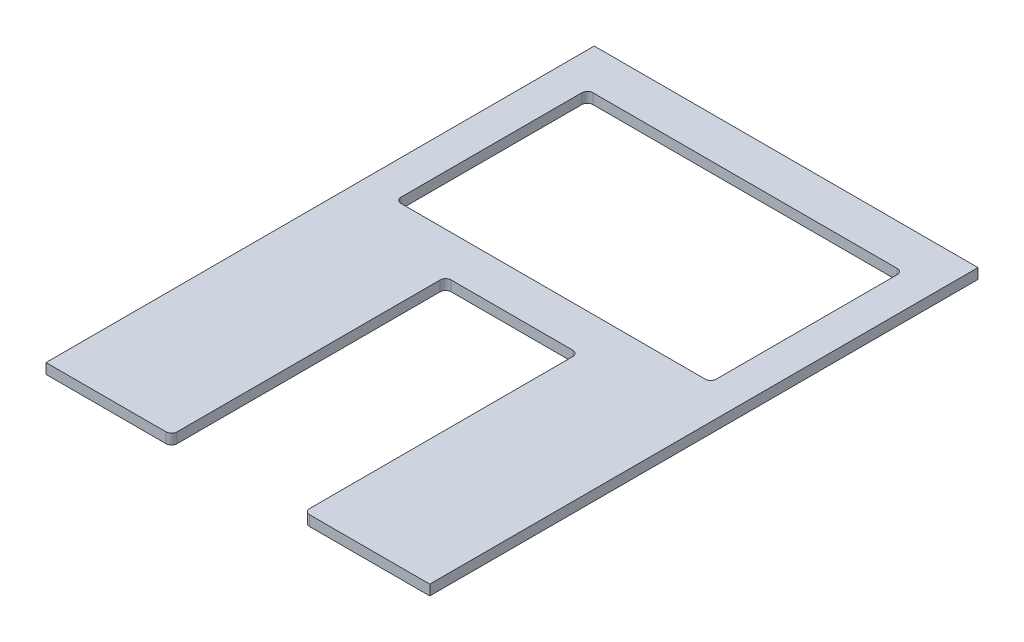
ISO-10303-21;
HEADER;
FILE_DESCRIPTION(('STEP AP214'),'2;1');
FILE_NAME('part.step','',(''),(''),'','','');
FILE_SCHEMA(('AUTOMOTIVE_DESIGN { 1 0 10303 214 1 1 1 1 }'));
ENDSEC;
DATA;
#1=APPLICATION_CONTEXT('core data for automotive mechanical design processes');
#2=APPLICATION_PROTOCOL_DEFINITION('international standard','automotive_design',2000,#1);
#3=PRODUCT_CONTEXT('',#1,'mechanical');
#4=PRODUCT('Part','Part','',(#3));
#5=PRODUCT_RELATED_PRODUCT_CATEGORY('part','',(#4));
#6=PRODUCT_DEFINITION_FORMATION('','',#4);
#7=PRODUCT_DEFINITION_CONTEXT('part definition',#1,'design');
#8=PRODUCT_DEFINITION('design','',#6,#7);
#9=PRODUCT_DEFINITION_SHAPE('','',#8);
#10=(LENGTH_UNIT() NAMED_UNIT(*) SI_UNIT(.MILLI.,.METRE.));
#11=(NAMED_UNIT(*) PLANE_ANGLE_UNIT() SI_UNIT($,.RADIAN.));
#12=(NAMED_UNIT(*) SI_UNIT($,.STERADIAN.) SOLID_ANGLE_UNIT());
#13=UNCERTAINTY_MEASURE_WITH_UNIT(LENGTH_MEASURE(1.E-05),#10,'distance_accuracy_value','');
#14=(GEOMETRIC_REPRESENTATION_CONTEXT(3) GLOBAL_UNCERTAINTY_ASSIGNED_CONTEXT((#13)) GLOBAL_UNIT_ASSIGNED_CONTEXT((#10,
#11,#12)) REPRESENTATION_CONTEXT('',''));
#15=CARTESIAN_POINT('',(0.,0.,0.));
#16=DIRECTION('',(0.,0.,1.));
#17=DIRECTION('',(1.,0.,0.));
#18=AXIS2_PLACEMENT_3D('',#15,#16,#17);
#19=CARTESIAN_POINT('',(-88.9,4.7625,127.));
#20=DIRECTION('',(0.,1.,0.));
#21=DIRECTION('',(0.,0.,1.));
#22=AXIS2_PLACEMENT_3D('',#19,#20,#21);
#23=PLANE('',#22);
#24=DIRECTION('',(0.,0.,1.));
#25=VECTOR('',#24,1.);
#26=CARTESIAN_POINT('',(30.734,4.7625,0.));
#27=LINE('',#26,#25);
#28=CARTESIAN_POINT('',(30.734,4.7625,2.53999999999994));
#29=VERTEX_POINT('',#28);
#30=CARTESIAN_POINT('',(30.734,4.7625,124.46));
#31=VERTEX_POINT('',#30);
#32=EDGE_CURVE('E181',#29,#31,#27,.T.);
#33=ORIENTED_EDGE('',*,*,#32,.T.);
#34=CARTESIAN_POINT('',(33.274,4.7625,124.46));
#35=DIRECTION('',(0.,1.,0.));
#36=DIRECTION('',(0.,0.,1.));
#37=AXIS2_PLACEMENT_3D('',#34,#35,#36);
#38=CIRCLE('',#37,2.54);
#39=CARTESIAN_POINT('',(33.274,4.7625,127.));
#40=VERTEX_POINT('',#39);
#41=EDGE_CURVE('E177',#31,#40,#38,.T.);
#42=ORIENTED_EDGE('',*,*,#41,.T.);
#43=DIRECTION('',(1.,0.,0.));
#44=VECTOR('',#43,1.);
#45=CARTESIAN_POINT('',(88.9,4.7625,127.));
#46=LINE('',#45,#44);
#47=CARTESIAN_POINT('',(88.9,4.7625,127.));
#48=VERTEX_POINT('',#47);
#49=EDGE_CURVE('E170',#40,#48,#46,.T.);
#50=ORIENTED_EDGE('',*,*,#49,.T.);
#51=DIRECTION('',(0.,0.,-1.));
#52=VECTOR('',#51,1.);
#53=CARTESIAN_POINT('',(88.9,4.7625,-127.));
#54=LINE('',#53,#52);
#55=CARTESIAN_POINT('',(88.9,4.7625,-127.));
#56=VERTEX_POINT('',#55);
#57=EDGE_CURVE('E174',#48,#56,#54,.T.);
#58=ORIENTED_EDGE('',*,*,#57,.T.);
#59=DIRECTION('',(-1.,0.,0.));
#60=VECTOR('',#59,1.);
#61=CARTESIAN_POINT('',(88.9,4.7625,-127.));
#62=LINE('',#61,#60);
#63=CARTESIAN_POINT('',(-88.9,4.7625,-127.));
#64=VERTEX_POINT('',#63);
#65=EDGE_CURVE('E196',#56,#64,#62,.T.);
#66=ORIENTED_EDGE('',*,*,#65,.T.);
#67=DIRECTION('',(0.,0.,1.));
#68=VECTOR('',#67,1.);
#69=CARTESIAN_POINT('',(-88.9,4.7625,-127.));
#70=LINE('',#69,#68);
#71=CARTESIAN_POINT('',(-88.9,4.7625,127.));
#72=VERTEX_POINT('',#71);
#73=EDGE_CURVE('E198',#64,#72,#70,.T.);
#74=ORIENTED_EDGE('',*,*,#73,.T.);
#75=DIRECTION('',(1.,0.,0.));
#76=VECTOR('',#75,1.);
#77=CARTESIAN_POINT('',(-30.734,4.7625,127.));
#78=LINE('',#77,#76);
#79=CARTESIAN_POINT('',(-33.274,4.7625,127.));
#80=VERTEX_POINT('',#79);
#81=EDGE_CURVE('E224',#72,#80,#78,.T.);
#82=ORIENTED_EDGE('',*,*,#81,.T.);
#83=CARTESIAN_POINT('',(-33.274,4.7625,124.46));
#84=DIRECTION('',(0.,1.,0.));
#85=DIRECTION('',(0.,0.,1.));
#86=AXIS2_PLACEMENT_3D('',#83,#84,#85);
#87=CIRCLE('',#86,2.54);
#88=CARTESIAN_POINT('',(-30.734,4.7625,124.46));
#89=VERTEX_POINT('',#88);
#90=EDGE_CURVE('E241',#80,#89,#87,.T.);
#91=ORIENTED_EDGE('',*,*,#90,.T.);
#92=DIRECTION('',(0.,0.,-1.));
#93=VECTOR('',#92,1.);
#94=CARTESIAN_POINT('',(-30.734,4.7625,127.));
#95=LINE('',#94,#93);
#96=CARTESIAN_POINT('',(-30.734,4.7625,2.53999999999994));
#97=VERTEX_POINT('',#96);
#98=EDGE_CURVE('E332',#89,#97,#95,.T.);
#99=ORIENTED_EDGE('',*,*,#98,.T.);
#100=CARTESIAN_POINT('',(-28.194,4.7625,2.53999999999994));
#101=DIRECTION('',(0.,1.,0.));
#102=DIRECTION('',(0.,0.,1.));
#103=AXIS2_PLACEMENT_3D('',#100,#101,#102);
#104=CIRCLE('',#103,2.54);
#105=CARTESIAN_POINT('',(-28.194,4.7625,0.));
#106=VERTEX_POINT('',#105);
#107=EDGE_CURVE('E277',#97,#106,#104,.F.);
#108=ORIENTED_EDGE('',*,*,#107,.T.);
#109=DIRECTION('',(1.,0.,0.));
#110=VECTOR('',#109,1.);
#111=CARTESIAN_POINT('',(-30.734,4.7625,0.));
#112=LINE('',#111,#110);
#113=CARTESIAN_POINT('',(28.194,4.7625,0.));
#114=VERTEX_POINT('',#113);
#115=EDGE_CURVE('E335',#106,#114,#112,.T.);
#116=ORIENTED_EDGE('',*,*,#115,.T.);
#117=CARTESIAN_POINT('',(28.194,4.7625,2.53999999999994));
#118=DIRECTION('',(0.,1.,0.));
#119=DIRECTION('',(0.,0.,1.));
#120=AXIS2_PLACEMENT_3D('',#117,#118,#119);
#121=CIRCLE('',#120,2.54);
#122=EDGE_CURVE('E281',#114,#29,#121,.F.);
#123=ORIENTED_EDGE('',*,*,#122,.T.);
#124=EDGE_LOOP('',(#33,#42,#50,#58,#66,#74,#82,#91,#99,#108,#116,#123));
#125=FACE_BOUND('',#124,.T.);
#126=DIRECTION('',(1.,0.,0.));
#127=VECTOR('',#126,1.);
#128=CARTESIAN_POINT('',(73.025,4.7625,-19.05));
#129=LINE('',#128,#127);
#130=CARTESIAN_POINT('',(-70.485,4.7625,-19.05));
#131=VERTEX_POINT('',#130);
#132=CARTESIAN_POINT('',(70.485,4.7625,-19.05));
#133=VERTEX_POINT('',#132);
#134=EDGE_CURVE('E320',#131,#133,#129,.T.);
#135=ORIENTED_EDGE('',*,*,#134,.F.);
#136=CARTESIAN_POINT('',(-70.485,4.7625,-21.59));
#137=DIRECTION('',(0.,1.,0.));
#138=DIRECTION('',(0.,0.,1.));
#139=AXIS2_PLACEMENT_3D('',#136,#137,#138);
#140=CIRCLE('',#139,2.54);
#141=CARTESIAN_POINT('',(-73.025,4.7625,-21.59));
#142=VERTEX_POINT('',#141);
#143=EDGE_CURVE('E285',#131,#142,#140,.F.);
#144=ORIENTED_EDGE('',*,*,#143,.T.);
#145=DIRECTION('',(0.,0.,1.));
#146=VECTOR('',#145,1.);
#147=CARTESIAN_POINT('',(-73.025,4.7625,-107.95));
#148=LINE('',#147,#146);
#149=CARTESIAN_POINT('',(-73.025,4.7625,-105.41));
#150=VERTEX_POINT('',#149);
#151=EDGE_CURVE('E314',#150,#142,#148,.T.);
#152=ORIENTED_EDGE('',*,*,#151,.F.);
#153=CARTESIAN_POINT('',(-70.485,4.7625,-105.41));
#154=DIRECTION('',(0.,1.,0.));
#155=DIRECTION('',(0.,0.,1.));
#156=AXIS2_PLACEMENT_3D('',#153,#154,#155);
#157=CIRCLE('',#156,2.54);
#158=CARTESIAN_POINT('',(-70.485,4.7625,-107.95));
#159=VERTEX_POINT('',#158);
#160=EDGE_CURVE('E11',#150,#159,#157,.F.);
#161=ORIENTED_EDGE('',*,*,#160,.T.);
#162=DIRECTION('',(-1.,0.,0.));
#163=VECTOR('',#162,1.);
#164=CARTESIAN_POINT('',(73.025,4.7625,-107.95));
#165=LINE('',#164,#163);
#166=CARTESIAN_POINT('',(70.485,4.7625,-107.95));
#167=VERTEX_POINT('',#166);
#168=EDGE_CURVE('E208',#167,#159,#165,.T.);
#169=ORIENTED_EDGE('',*,*,#168,.F.);
#170=CARTESIAN_POINT('',(70.485,4.7625,-105.41));
#171=DIRECTION('',(0.,1.,0.));
#172=DIRECTION('',(0.,0.,1.));
#173=AXIS2_PLACEMENT_3D('',#170,#171,#172);
#174=CIRCLE('',#173,2.54);
#175=CARTESIAN_POINT('',(73.025,4.7625,-105.41));
#176=VERTEX_POINT('',#175);
#177=EDGE_CURVE('E48',#167,#176,#174,.F.);
#178=ORIENTED_EDGE('',*,*,#177,.T.);
#179=DIRECTION('',(0.,0.,-1.));
#180=VECTOR('',#179,1.);
#181=CARTESIAN_POINT('',(73.025,4.7625,-107.95));
#182=LINE('',#181,#180);
#183=CARTESIAN_POINT('',(73.025,4.7625,-21.59));
#184=VERTEX_POINT('',#183);
#185=EDGE_CURVE('E318',#184,#176,#182,.T.);
#186=ORIENTED_EDGE('',*,*,#185,.F.);
#187=CARTESIAN_POINT('',(70.485,4.7625,-21.59));
#188=DIRECTION('',(0.,1.,0.));
#189=DIRECTION('',(0.,0.,1.));
#190=AXIS2_PLACEMENT_3D('',#187,#188,#189);
#191=CIRCLE('',#190,2.54);
#192=EDGE_CURVE('E289',#184,#133,#191,.F.);
#193=ORIENTED_EDGE('',*,*,#192,.T.);
#194=EDGE_LOOP('',(#135,#144,#152,#161,#169,#178,#186,#193));
#195=FACE_BOUND('',#194,.T.);
#196=ADVANCED_FACE('F33',(#125,#195),#23,.T.);
#197=CARTESIAN_POINT('',(-88.9,0.,127.));
#198=DIRECTION('',(0.,1.,0.));
#199=DIRECTION('',(0.,0.,1.));
#200=AXIS2_PLACEMENT_3D('',#197,#198,#199);
#201=PLANE('',#200);
#202=DIRECTION('',(1.,0.,0.));
#203=VECTOR('',#202,1.);
#204=CARTESIAN_POINT('',(88.9,0.,127.));
#205=LINE('',#204,#203);
#206=CARTESIAN_POINT('',(33.274,0.,127.));
#207=VERTEX_POINT('',#206);
#208=CARTESIAN_POINT('',(88.9,0.,127.));
#209=VERTEX_POINT('',#208);
#210=EDGE_CURVE('E187',#207,#209,#205,.T.);
#211=ORIENTED_EDGE('',*,*,#210,.F.);
#212=CARTESIAN_POINT('',(33.274,0.,124.46));
#213=DIRECTION('',(0.,1.,0.));
#214=DIRECTION('',(0.,0.,1.));
#215=AXIS2_PLACEMENT_3D('',#212,#213,#214);
#216=CIRCLE('',#215,2.54);
#217=CARTESIAN_POINT('',(30.734,0.,124.46));
#218=VERTEX_POINT('',#217);
#219=EDGE_CURVE('E234',#207,#218,#216,.F.);
#220=ORIENTED_EDGE('',*,*,#219,.T.);
#221=DIRECTION('',(0.,0.,1.));
#222=VECTOR('',#221,1.);
#223=CARTESIAN_POINT('',(30.734,0.,0.));
#224=LINE('',#223,#222);
#225=CARTESIAN_POINT('',(30.734,0.,2.53999999999994));
#226=VERTEX_POINT('',#225);
#227=EDGE_CURVE('E214',#226,#218,#224,.T.);
#228=ORIENTED_EDGE('',*,*,#227,.F.);
#229=CARTESIAN_POINT('',(28.194,0.,2.53999999999994));
#230=DIRECTION('',(0.,1.,0.));
#231=DIRECTION('',(0.,0.,1.));
#232=AXIS2_PLACEMENT_3D('',#229,#230,#231);
#233=CIRCLE('',#232,2.54);
#234=CARTESIAN_POINT('',(28.194,0.,0.));
#235=VERTEX_POINT('',#234);
#236=EDGE_CURVE('E279',#226,#235,#233,.T.);
#237=ORIENTED_EDGE('',*,*,#236,.T.);
#238=DIRECTION('',(1.,0.,0.));
#239=VECTOR('',#238,1.);
#240=CARTESIAN_POINT('',(-30.734,0.,0.));
#241=LINE('',#240,#239);
#242=CARTESIAN_POINT('',(-28.194,0.,0.));
#243=VERTEX_POINT('',#242);
#244=EDGE_CURVE('E211',#243,#235,#241,.T.);
#245=ORIENTED_EDGE('',*,*,#244,.F.);
#246=CARTESIAN_POINT('',(-28.194,0.,2.53999999999994));
#247=DIRECTION('',(0.,1.,0.));
#248=DIRECTION('',(0.,0.,1.));
#249=AXIS2_PLACEMENT_3D('',#246,#247,#248);
#250=CIRCLE('',#249,2.54);
#251=CARTESIAN_POINT('',(-30.734,0.,2.53999999999994));
#252=VERTEX_POINT('',#251);
#253=EDGE_CURVE('E275',#243,#252,#250,.T.);
#254=ORIENTED_EDGE('',*,*,#253,.T.);
#255=DIRECTION('',(0.,0.,-1.));
#256=VECTOR('',#255,1.);
#257=CARTESIAN_POINT('',(-30.734,0.,127.));
#258=LINE('',#257,#256);
#259=CARTESIAN_POINT('',(-30.734,0.,124.46));
#260=VERTEX_POINT('',#259);
#261=EDGE_CURVE('E207',#260,#252,#258,.T.);
#262=ORIENTED_EDGE('',*,*,#261,.F.);
#263=CARTESIAN_POINT('',(-33.274,0.,124.46));
#264=DIRECTION('',(0.,1.,0.));
#265=DIRECTION('',(0.,0.,1.));
#266=AXIS2_PLACEMENT_3D('',#263,#264,#265);
#267=CIRCLE('',#266,2.54);
#268=CARTESIAN_POINT('',(-33.274,0.,127.));
#269=VERTEX_POINT('',#268);
#270=EDGE_CURVE('E232',#260,#269,#267,.F.);
#271=ORIENTED_EDGE('',*,*,#270,.T.);
#272=DIRECTION('',(1.,0.,0.));
#273=VECTOR('',#272,1.);
#274=CARTESIAN_POINT('',(-30.734,0.,127.));
#275=LINE('',#274,#273);
#276=CARTESIAN_POINT('',(-88.9,0.,127.));
#277=VERTEX_POINT('',#276);
#278=EDGE_CURVE('E204',#277,#269,#275,.T.);
#279=ORIENTED_EDGE('',*,*,#278,.F.);
#280=DIRECTION('',(0.,0.,1.));
#281=VECTOR('',#280,1.);
#282=CARTESIAN_POINT('',(-88.9,0.,-127.));
#283=LINE('',#282,#281);
#284=CARTESIAN_POINT('',(-88.9,0.,-127.));
#285=VERTEX_POINT('',#284);
#286=EDGE_CURVE('E222',#285,#277,#283,.T.);
#287=ORIENTED_EDGE('',*,*,#286,.F.);
#288=DIRECTION('',(-1.,0.,0.));
#289=VECTOR('',#288,1.);
#290=CARTESIAN_POINT('',(88.9,0.,-127.));
#291=LINE('',#290,#289);
#292=CARTESIAN_POINT('',(88.9,0.,-127.));
#293=VERTEX_POINT('',#292);
#294=EDGE_CURVE('E220',#293,#285,#291,.T.);
#295=ORIENTED_EDGE('',*,*,#294,.F.);
#296=DIRECTION('',(0.,0.,-1.));
#297=VECTOR('',#296,1.);
#298=CARTESIAN_POINT('',(88.9,0.,-127.));
#299=LINE('',#298,#297);
#300=EDGE_CURVE('E218',#209,#293,#299,.T.);
#301=ORIENTED_EDGE('',*,*,#300,.F.);
#302=EDGE_LOOP('',(#211,#220,#228,#237,#245,#254,#262,#271,#279,#287,#295,#301));
#303=FACE_BOUND('',#302,.T.);
#304=DIRECTION('',(-1.,0.,0.));
#305=VECTOR('',#304,1.);
#306=CARTESIAN_POINT('',(73.025,0.,-107.95));
#307=LINE('',#306,#305);
#308=CARTESIAN_POINT('',(70.485,0.,-107.95));
#309=VERTEX_POINT('',#308);
#310=CARTESIAN_POINT('',(-70.485,0.,-107.95));
#311=VERTEX_POINT('',#310);
#312=EDGE_CURVE('E300',#309,#311,#307,.T.);
#313=ORIENTED_EDGE('',*,*,#312,.T.);
#314=CARTESIAN_POINT('',(-70.485,0.,-105.41));
#315=DIRECTION('',(0.,1.,0.));
#316=DIRECTION('',(0.,0.,1.));
#317=AXIS2_PLACEMENT_3D('',#314,#315,#316);
#318=CIRCLE('',#317,2.54);
#319=CARTESIAN_POINT('',(-73.025,0.,-105.41));
#320=VERTEX_POINT('',#319);
#321=EDGE_CURVE('E41',#311,#320,#318,.T.);
#322=ORIENTED_EDGE('',*,*,#321,.T.);
#323=DIRECTION('',(0.,0.,1.));
#324=VECTOR('',#323,1.);
#325=CARTESIAN_POINT('',(-73.025,0.,-107.95));
#326=LINE('',#325,#324);
#327=CARTESIAN_POINT('',(-73.025,0.,-21.59));
#328=VERTEX_POINT('',#327);
#329=EDGE_CURVE('E298',#320,#328,#326,.T.);
#330=ORIENTED_EDGE('',*,*,#329,.T.);
#331=CARTESIAN_POINT('',(-70.485,0.,-21.59));
#332=DIRECTION('',(0.,1.,0.));
#333=DIRECTION('',(0.,0.,1.));
#334=AXIS2_PLACEMENT_3D('',#331,#332,#333);
#335=CIRCLE('',#334,2.54);
#336=CARTESIAN_POINT('',(-70.485,0.,-19.05));
#337=VERTEX_POINT('',#336);
#338=EDGE_CURVE('E283',#328,#337,#335,.T.);
#339=ORIENTED_EDGE('',*,*,#338,.T.);
#340=DIRECTION('',(1.,0.,0.));
#341=VECTOR('',#340,1.);
#342=CARTESIAN_POINT('',(73.025,0.,-19.05));
#343=LINE('',#342,#341);
#344=CARTESIAN_POINT('',(70.485,0.,-19.05));
#345=VERTEX_POINT('',#344);
#346=EDGE_CURVE('E309',#337,#345,#343,.T.);
#347=ORIENTED_EDGE('',*,*,#346,.T.);
#348=CARTESIAN_POINT('',(70.485,0.,-21.59));
#349=DIRECTION('',(0.,1.,0.));
#350=DIRECTION('',(0.,0.,1.));
#351=AXIS2_PLACEMENT_3D('',#348,#349,#350);
#352=CIRCLE('',#351,2.54);
#353=CARTESIAN_POINT('',(73.025,0.,-21.59));
#354=VERTEX_POINT('',#353);
#355=EDGE_CURVE('E287',#345,#354,#352,.T.);
#356=ORIENTED_EDGE('',*,*,#355,.T.);
#357=DIRECTION('',(0.,0.,-1.));
#358=VECTOR('',#357,1.);
#359=CARTESIAN_POINT('',(73.025,0.,-107.95));
#360=LINE('',#359,#358);
#361=CARTESIAN_POINT('',(73.025,0.,-105.41));
#362=VERTEX_POINT('',#361);
#363=EDGE_CURVE('E326',#354,#362,#360,.T.);
#364=ORIENTED_EDGE('',*,*,#363,.T.);
#365=CARTESIAN_POINT('',(70.485,0.,-105.41));
#366=DIRECTION('',(0.,1.,0.));
#367=DIRECTION('',(0.,0.,1.));
#368=AXIS2_PLACEMENT_3D('',#365,#366,#367);
#369=CIRCLE('',#368,2.54);
#370=EDGE_CURVE('E291',#362,#309,#369,.T.);
#371=ORIENTED_EDGE('',*,*,#370,.T.);
#372=EDGE_LOOP('',(#313,#322,#330,#339,#347,#356,#364,#371));
#373=FACE_BOUND('',#372,.T.);
#374=ADVANCED_FACE('F297',(#303,#373),#201,.F.);
#375=CARTESIAN_POINT('',(-30.734,4.7625,127.));
#376=DIRECTION('',(0.,0.,-1.));
#377=DIRECTION('',(-1.,0.,0.));
#378=AXIS2_PLACEMENT_3D('',#375,#376,#377);
#379=PLANE('',#378);
#380=ORIENTED_EDGE('',*,*,#278,.T.);
#381=DIRECTION('',(0.,-1.,0.));
#382=VECTOR('',#381,1.);
#383=CARTESIAN_POINT('',(-33.274,4.7625,127.));
#384=LINE('',#383,#382);
#385=EDGE_CURVE('E249',#269,#80,#384,.F.);
#386=ORIENTED_EDGE('',*,*,#385,.T.);
#387=ORIENTED_EDGE('',*,*,#81,.F.);
#388=DIRECTION('',(0.,-1.,0.));
#389=VECTOR('',#388,1.);
#390=CARTESIAN_POINT('',(-88.9,4.7625,127.));
#391=LINE('',#390,#389);
#392=EDGE_CURVE('E203',#72,#277,#391,.T.);
#393=ORIENTED_EDGE('',*,*,#392,.T.);
#394=EDGE_LOOP('',(#380,#386,#387,#393));
#395=FACE_BOUND('',#394,.T.);
#396=ADVANCED_FACE('F359',(#395),#379,.F.);
#397=CARTESIAN_POINT('',(-30.734,4.7625,127.));
#398=DIRECTION('',(-1.,0.,0.));
#399=DIRECTION('',(0.,0.,1.));
#400=AXIS2_PLACEMENT_3D('',#397,#398,#399);
#401=PLANE('',#400);
#402=ORIENTED_EDGE('',*,*,#98,.F.);
#403=DIRECTION('',(0.,-1.,0.));
#404=VECTOR('',#403,1.);
#405=CARTESIAN_POINT('',(-30.734,4.7625,124.46));
#406=LINE('',#405,#404);
#407=EDGE_CURVE('E246',#89,#260,#406,.T.);
#408=ORIENTED_EDGE('',*,*,#407,.T.);
#409=ORIENTED_EDGE('',*,*,#261,.T.);
#410=DIRECTION('',(0.,-1.,0.));
#411=VECTOR('',#410,1.);
#412=CARTESIAN_POINT('',(-30.734,4.7625,2.53999999999994));
#413=LINE('',#412,#411);
#414=EDGE_CURVE('E244',#252,#97,#413,.F.);
#415=ORIENTED_EDGE('',*,*,#414,.T.);
#416=EDGE_LOOP('',(#402,#408,#409,#415));
#417=FACE_BOUND('',#416,.T.);
#418=ADVANCED_FACE('F367',(#417),#401,.F.);
#419=CARTESIAN_POINT('',(-30.734,4.7625,0.));
#420=DIRECTION('',(0.,0.,-1.));
#421=DIRECTION('',(-1.,0.,0.));
#422=AXIS2_PLACEMENT_3D('',#419,#420,#421);
#423=PLANE('',#422);
#424=ORIENTED_EDGE('',*,*,#115,.F.);
#425=DIRECTION('',(0.,-1.,0.));
#426=VECTOR('',#425,1.);
#427=CARTESIAN_POINT('',(-28.194,0.,0.));
#428=LINE('',#427,#426);
#429=EDGE_CURVE('E253',#106,#243,#428,.T.);
#430=ORIENTED_EDGE('',*,*,#429,.T.);
#431=ORIENTED_EDGE('',*,*,#244,.T.);
#432=DIRECTION('',(0.,-1.,0.));
#433=VECTOR('',#432,1.);
#434=CARTESIAN_POINT('',(28.194,4.7625,0.));
#435=LINE('',#434,#433);
#436=EDGE_CURVE('E251',#235,#114,#435,.F.);
#437=ORIENTED_EDGE('',*,*,#436,.T.);
#438=EDGE_LOOP('',(#424,#430,#431,#437));
#439=FACE_BOUND('',#438,.T.);
#440=ADVANCED_FACE('F375',(#439),#423,.F.);
#441=CARTESIAN_POINT('',(30.734,4.7625,0.));
#442=DIRECTION('',(1.,0.,0.));
#443=DIRECTION('',(0.,0.,-1.));
#444=AXIS2_PLACEMENT_3D('',#441,#442,#443);
#445=PLANE('',#444);
#446=ORIENTED_EDGE('',*,*,#227,.T.);
#447=DIRECTION('',(0.,-1.,0.));
#448=VECTOR('',#447,1.);
#449=CARTESIAN_POINT('',(30.734,4.7625,124.46));
#450=LINE('',#449,#448);
#451=EDGE_CURVE('E239',#218,#31,#450,.F.);
#452=ORIENTED_EDGE('',*,*,#451,.T.);
#453=ORIENTED_EDGE('',*,*,#32,.F.);
#454=DIRECTION('',(0.,-1.,0.));
#455=VECTOR('',#454,1.);
#456=CARTESIAN_POINT('',(30.734,0.,2.53999999999994));
#457=LINE('',#456,#455);
#458=EDGE_CURVE('E236',#29,#226,#457,.T.);
#459=ORIENTED_EDGE('',*,*,#458,.T.);
#460=EDGE_LOOP('',(#446,#452,#453,#459));
#461=FACE_BOUND('',#460,.T.);
#462=ADVANCED_FACE('F380',(#461),#445,.F.);
#463=CARTESIAN_POINT('',(88.9,4.7625,127.));
#464=DIRECTION('',(0.,0.,-1.));
#465=DIRECTION('',(-1.,0.,0.));
#466=AXIS2_PLACEMENT_3D('',#463,#464,#465);
#467=PLANE('',#466);
#468=ORIENTED_EDGE('',*,*,#49,.F.);
#469=DIRECTION('',(0.,-1.,0.));
#470=VECTOR('',#469,1.);
#471=CARTESIAN_POINT('',(33.274,4.7625,127.));
#472=LINE('',#471,#470);
#473=EDGE_CURVE('E190',#40,#207,#472,.T.);
#474=ORIENTED_EDGE('',*,*,#473,.T.);
#475=ORIENTED_EDGE('',*,*,#210,.T.);
#476=DIRECTION('',(0.,-1.,0.));
#477=VECTOR('',#476,1.);
#478=CARTESIAN_POINT('',(88.9,4.7625,127.));
#479=LINE('',#478,#477);
#480=EDGE_CURVE('E184',#48,#209,#479,.T.);
#481=ORIENTED_EDGE('',*,*,#480,.F.);
#482=EDGE_LOOP('',(#468,#474,#475,#481));
#483=FACE_BOUND('',#482,.T.);
#484=ADVANCED_FACE('F185',(#483),#467,.F.);
#485=CARTESIAN_POINT('',(88.9,4.7625,-127.));
#486=DIRECTION('',(-1.,0.,0.));
#487=DIRECTION('',(0.,0.,1.));
#488=AXIS2_PLACEMENT_3D('',#485,#486,#487);
#489=PLANE('',#488);
#490=ORIENTED_EDGE('',*,*,#300,.T.);
#491=DIRECTION('',(0.,-1.,0.));
#492=VECTOR('',#491,1.);
#493=CARTESIAN_POINT('',(88.9,4.7625,-127.));
#494=LINE('',#493,#492);
#495=EDGE_CURVE('E191',#56,#293,#494,.T.);
#496=ORIENTED_EDGE('',*,*,#495,.F.);
#497=ORIENTED_EDGE('',*,*,#57,.F.);
#498=ORIENTED_EDGE('',*,*,#480,.T.);
#499=EDGE_LOOP('',(#490,#496,#497,#498));
#500=FACE_BOUND('',#499,.T.);
#501=ADVANCED_FACE('F193',(#500),#489,.F.);
#502=CARTESIAN_POINT('',(88.9,4.7625,-127.));
#503=DIRECTION('',(0.,0.,1.));
#504=DIRECTION('',(1.,0.,0.));
#505=AXIS2_PLACEMENT_3D('',#502,#503,#504);
#506=PLANE('',#505);
#507=ORIENTED_EDGE('',*,*,#294,.T.);
#508=DIRECTION('',(0.,-1.,0.));
#509=VECTOR('',#508,1.);
#510=CARTESIAN_POINT('',(-88.9,4.7625,-127.));
#511=LINE('',#510,#509);
#512=EDGE_CURVE('E227',#64,#285,#511,.T.);
#513=ORIENTED_EDGE('',*,*,#512,.F.);
#514=ORIENTED_EDGE('',*,*,#65,.F.);
#515=ORIENTED_EDGE('',*,*,#495,.T.);
#516=EDGE_LOOP('',(#507,#513,#514,#515));
#517=FACE_BOUND('',#516,.T.);
#518=ADVANCED_FACE('F349',(#517),#506,.F.);
#519=CARTESIAN_POINT('',(-88.9,4.7625,-127.));
#520=DIRECTION('',(1.,0.,0.));
#521=DIRECTION('',(0.,0.,-1.));
#522=AXIS2_PLACEMENT_3D('',#519,#520,#521);
#523=PLANE('',#522);
#524=ORIENTED_EDGE('',*,*,#286,.T.);
#525=ORIENTED_EDGE('',*,*,#392,.F.);
#526=ORIENTED_EDGE('',*,*,#73,.F.);
#527=ORIENTED_EDGE('',*,*,#512,.T.);
#528=EDGE_LOOP('',(#524,#525,#526,#527));
#529=FACE_BOUND('',#528,.T.);
#530=ADVANCED_FACE('F356',(#529),#523,.F.);
#531=CARTESIAN_POINT('',(-73.025,4.7625,-107.95));
#532=DIRECTION('',(1.,0.,0.));
#533=DIRECTION('',(0.,0.,-1.));
#534=AXIS2_PLACEMENT_3D('',#531,#532,#533);
#535=PLANE('',#534);
#536=ORIENTED_EDGE('',*,*,#151,.T.);
#537=DIRECTION('',(0.,-1.,0.));
#538=VECTOR('',#537,1.);
#539=CARTESIAN_POINT('',(-73.025,0.,-21.59));
#540=LINE('',#539,#538);
#541=EDGE_CURVE('E258',#142,#328,#540,.T.);
#542=ORIENTED_EDGE('',*,*,#541,.T.);
#543=ORIENTED_EDGE('',*,*,#329,.F.);
#544=DIRECTION('',(0.,-1.,0.));
#545=VECTOR('',#544,1.);
#546=CARTESIAN_POINT('',(-73.025,4.7625,-105.41));
#547=LINE('',#546,#545);
#548=EDGE_CURVE('E256',#320,#150,#547,.F.);
#549=ORIENTED_EDGE('',*,*,#548,.T.);
#550=EDGE_LOOP('',(#536,#542,#543,#549));
#551=FACE_BOUND('',#550,.T.);
#552=ADVANCED_FACE('F306',(#551),#535,.T.);
#553=CARTESIAN_POINT('',(73.025,4.7625,-19.05));
#554=DIRECTION('',(0.,0.,-1.));
#555=DIRECTION('',(-1.,0.,0.));
#556=AXIS2_PLACEMENT_3D('',#553,#554,#555);
#557=PLANE('',#556);
#558=ORIENTED_EDGE('',*,*,#346,.F.);
#559=DIRECTION('',(0.,-1.,0.));
#560=VECTOR('',#559,1.);
#561=CARTESIAN_POINT('',(-70.485,4.7625,-19.05));
#562=LINE('',#561,#560);
#563=EDGE_CURVE('E264',#337,#131,#562,.F.);
#564=ORIENTED_EDGE('',*,*,#563,.T.);
#565=ORIENTED_EDGE('',*,*,#134,.T.);
#566=DIRECTION('',(0.,-1.,0.));
#567=VECTOR('',#566,1.);
#568=CARTESIAN_POINT('',(70.485,0.,-19.05));
#569=LINE('',#568,#567);
#570=EDGE_CURVE('E261',#133,#345,#569,.T.);
#571=ORIENTED_EDGE('',*,*,#570,.T.);
#572=EDGE_LOOP('',(#558,#564,#565,#571));
#573=FACE_BOUND('',#572,.T.);
#574=ADVANCED_FACE('F421',(#573),#557,.T.);
#575=CARTESIAN_POINT('',(73.025,4.7625,-107.95));
#576=DIRECTION('',(-1.,0.,0.));
#577=DIRECTION('',(0.,0.,1.));
#578=AXIS2_PLACEMENT_3D('',#575,#576,#577);
#579=PLANE('',#578);
#580=ORIENTED_EDGE('',*,*,#363,.F.);
#581=DIRECTION('',(0.,-1.,0.));
#582=VECTOR('',#581,1.);
#583=CARTESIAN_POINT('',(73.025,4.7625,-21.59));
#584=LINE('',#583,#582);
#585=EDGE_CURVE('E55',#354,#184,#584,.F.);
#586=ORIENTED_EDGE('',*,*,#585,.T.);
#587=ORIENTED_EDGE('',*,*,#185,.T.);
#588=DIRECTION('',(0.,-1.,0.));
#589=VECTOR('',#588,1.);
#590=CARTESIAN_POINT('',(73.025,0.,-105.41));
#591=LINE('',#590,#589);
#592=EDGE_CURVE('E266',#176,#362,#591,.T.);
#593=ORIENTED_EDGE('',*,*,#592,.T.);
#594=EDGE_LOOP('',(#580,#586,#587,#593));
#595=FACE_BOUND('',#594,.T.);
#596=ADVANCED_FACE('F427',(#595),#579,.T.);
#597=CARTESIAN_POINT('',(73.025,4.7625,-107.95));
#598=DIRECTION('',(0.,0.,1.));
#599=DIRECTION('',(1.,0.,0.));
#600=AXIS2_PLACEMENT_3D('',#597,#598,#599);
#601=PLANE('',#600);
#602=ORIENTED_EDGE('',*,*,#312,.F.);
#603=DIRECTION('',(0.,-1.,0.));
#604=VECTOR('',#603,1.);
#605=CARTESIAN_POINT('',(70.485,4.7625,-107.95));
#606=LINE('',#605,#604);
#607=EDGE_CURVE('E273',#309,#167,#606,.F.);
#608=ORIENTED_EDGE('',*,*,#607,.T.);
#609=ORIENTED_EDGE('',*,*,#168,.T.);
#610=DIRECTION('',(0.,-1.,0.));
#611=VECTOR('',#610,1.);
#612=CARTESIAN_POINT('',(-70.485,0.,-107.95));
#613=LINE('',#612,#611);
#614=EDGE_CURVE('E270',#159,#311,#613,.T.);
#615=ORIENTED_EDGE('',*,*,#614,.T.);
#616=EDGE_LOOP('',(#602,#608,#609,#615));
#617=FACE_BOUND('',#616,.T.);
#618=ADVANCED_FACE('F316',(#617),#601,.T.);
#619=CARTESIAN_POINT('',(33.274,4.7625,124.46));
#620=DIRECTION('',(0.,-1.,0.));
#621=DIRECTION('',(0.,0.,-1.));
#622=AXIS2_PLACEMENT_3D('',#619,#620,#621);
#623=CYLINDRICAL_SURFACE('',#622,2.54);
#624=ORIENTED_EDGE('',*,*,#41,.F.);
#625=ORIENTED_EDGE('',*,*,#451,.F.);
#626=ORIENTED_EDGE('',*,*,#219,.F.);
#627=ORIENTED_EDGE('',*,*,#473,.F.);
#628=EDGE_LOOP('',(#624,#625,#626,#627));
#629=FACE_BOUND('',#628,.T.);
#630=ADVANCED_FACE('F343',(#629),#623,.T.);
#631=CARTESIAN_POINT('',(-33.274,4.7625,124.46));
#632=DIRECTION('',(0.,-1.,0.));
#633=DIRECTION('',(0.,0.,-1.));
#634=AXIS2_PLACEMENT_3D('',#631,#632,#633);
#635=CYLINDRICAL_SURFACE('',#634,2.54);
#636=ORIENTED_EDGE('',*,*,#90,.F.);
#637=ORIENTED_EDGE('',*,*,#385,.F.);
#638=ORIENTED_EDGE('',*,*,#270,.F.);
#639=ORIENTED_EDGE('',*,*,#407,.F.);
#640=EDGE_LOOP('',(#636,#637,#638,#639));
#641=FACE_BOUND('',#640,.T.);
#642=ADVANCED_FACE('F362',(#641),#635,.T.);
#643=CARTESIAN_POINT('',(-28.194,4.7625,2.53999999999994));
#644=DIRECTION('',(0.,1.,0.));
#645=DIRECTION('',(0.,0.,1.));
#646=AXIS2_PLACEMENT_3D('',#643,#644,#645);
#647=CYLINDRICAL_SURFACE('',#646,2.54);
#648=ORIENTED_EDGE('',*,*,#107,.F.);
#649=ORIENTED_EDGE('',*,*,#414,.F.);
#650=ORIENTED_EDGE('',*,*,#253,.F.);
#651=ORIENTED_EDGE('',*,*,#429,.F.);
#652=EDGE_LOOP('',(#648,#649,#650,#651));
#653=FACE_BOUND('',#652,.T.);
#654=ADVANCED_FACE('F371',(#653),#647,.F.);
#655=CARTESIAN_POINT('',(28.194,4.7625,2.53999999999994));
#656=DIRECTION('',(0.,1.,0.));
#657=DIRECTION('',(0.,0.,1.));
#658=AXIS2_PLACEMENT_3D('',#655,#656,#657);
#659=CYLINDRICAL_SURFACE('',#658,2.54);
#660=ORIENTED_EDGE('',*,*,#122,.F.);
#661=ORIENTED_EDGE('',*,*,#436,.F.);
#662=ORIENTED_EDGE('',*,*,#236,.F.);
#663=ORIENTED_EDGE('',*,*,#458,.F.);
#664=EDGE_LOOP('',(#660,#661,#662,#663));
#665=FACE_BOUND('',#664,.T.);
#666=ADVANCED_FACE('F379',(#665),#659,.F.);
#667=CARTESIAN_POINT('',(-70.485,4.7625,-21.59));
#668=DIRECTION('',(0.,1.,0.));
#669=DIRECTION('',(0.,0.,1.));
#670=AXIS2_PLACEMENT_3D('',#667,#668,#669);
#671=CYLINDRICAL_SURFACE('',#670,2.54);
#672=ORIENTED_EDGE('',*,*,#143,.F.);
#673=ORIENTED_EDGE('',*,*,#563,.F.);
#674=ORIENTED_EDGE('',*,*,#338,.F.);
#675=ORIENTED_EDGE('',*,*,#541,.F.);
#676=EDGE_LOOP('',(#672,#673,#674,#675));
#677=FACE_BOUND('',#676,.T.);
#678=ADVANCED_FACE('F464',(#677),#671,.F.);
#679=CARTESIAN_POINT('',(70.485,4.7625,-21.59));
#680=DIRECTION('',(0.,1.,0.));
#681=DIRECTION('',(0.,0.,1.));
#682=AXIS2_PLACEMENT_3D('',#679,#680,#681);
#683=CYLINDRICAL_SURFACE('',#682,2.54);
#684=ORIENTED_EDGE('',*,*,#192,.F.);
#685=ORIENTED_EDGE('',*,*,#585,.F.);
#686=ORIENTED_EDGE('',*,*,#355,.F.);
#687=ORIENTED_EDGE('',*,*,#570,.F.);
#688=EDGE_LOOP('',(#684,#685,#686,#687));
#689=FACE_BOUND('',#688,.T.);
#690=ADVANCED_FACE('F471',(#689),#683,.F.);
#691=CARTESIAN_POINT('',(70.485,4.7625,-105.41));
#692=DIRECTION('',(0.,1.,0.));
#693=DIRECTION('',(0.,0.,1.));
#694=AXIS2_PLACEMENT_3D('',#691,#692,#693);
#695=CYLINDRICAL_SURFACE('',#694,2.54);
#696=ORIENTED_EDGE('',*,*,#177,.F.);
#697=ORIENTED_EDGE('',*,*,#607,.F.);
#698=ORIENTED_EDGE('',*,*,#370,.F.);
#699=ORIENTED_EDGE('',*,*,#592,.F.);
#700=EDGE_LOOP('',(#696,#697,#698,#699));
#701=FACE_BOUND('',#700,.T.);
#702=ADVANCED_FACE('F479',(#701),#695,.F.);
#703=CARTESIAN_POINT('',(-70.485,4.7625,-105.41));
#704=DIRECTION('',(0.,1.,0.));
#705=DIRECTION('',(0.,0.,1.));
#706=AXIS2_PLACEMENT_3D('',#703,#704,#705);
#707=CYLINDRICAL_SURFACE('',#706,2.54);
#708=ORIENTED_EDGE('',*,*,#160,.F.);
#709=ORIENTED_EDGE('',*,*,#548,.F.);
#710=ORIENTED_EDGE('',*,*,#321,.F.);
#711=ORIENTED_EDGE('',*,*,#614,.F.);
#712=EDGE_LOOP('',(#708,#709,#710,#711));
#713=FACE_BOUND('',#712,.T.);
#714=ADVANCED_FACE('F35',(#713),#707,.F.);
#715=CLOSED_SHELL('',(#196,#374,#396,#418,#440,#462,#484,#501,#518,#530,#552,#574,#596,#618,
#630,#642,#654,#666,#678,#690,#702,#714));
#716=MANIFOLD_SOLID_BREP('B2',#715);
#717=ADVANCED_BREP_SHAPE_REPRESENTATION('',(#18,#716),#14);
#718=SHAPE_DEFINITION_REPRESENTATION(#9,#717);
ENDSEC;
END-ISO-10303-21;
